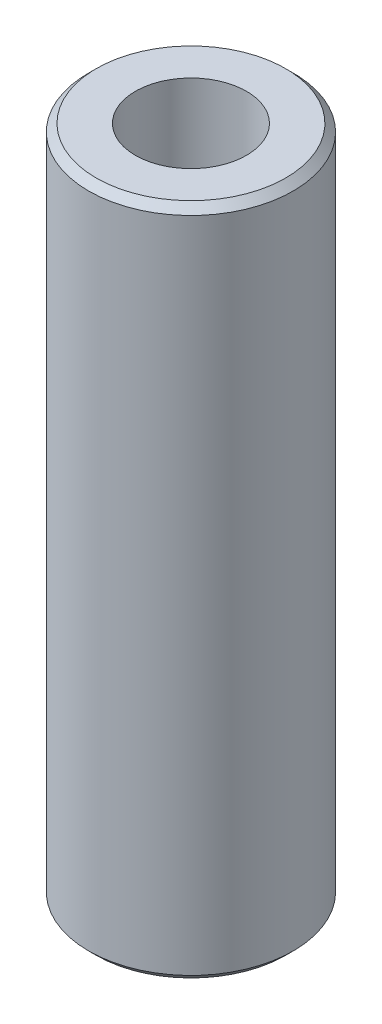
ISO-10303-21;
HEADER;
FILE_DESCRIPTION(('STEP AP214'),'2;1');
FILE_NAME('part.step','',(''),(''),'','','');
FILE_SCHEMA(('AUTOMOTIVE_DESIGN { 1 0 10303 214 1 1 1 1 }'));
ENDSEC;
DATA;
#1=APPLICATION_CONTEXT('core data for automotive mechanical design processes');
#2=APPLICATION_PROTOCOL_DEFINITION('international standard','automotive_design',2000,#1);
#3=PRODUCT_CONTEXT('',#1,'mechanical');
#4=PRODUCT('Part','Part','',(#3));
#5=PRODUCT_RELATED_PRODUCT_CATEGORY('part','',(#4));
#6=PRODUCT_DEFINITION_FORMATION('','',#4);
#7=PRODUCT_DEFINITION_CONTEXT('part definition',#1,'design');
#8=PRODUCT_DEFINITION('design','',#6,#7);
#9=PRODUCT_DEFINITION_SHAPE('','',#8);
#10=(LENGTH_UNIT() NAMED_UNIT(*) SI_UNIT(.MILLI.,.METRE.));
#11=(NAMED_UNIT(*) PLANE_ANGLE_UNIT() SI_UNIT($,.RADIAN.));
#12=(NAMED_UNIT(*) SI_UNIT($,.STERADIAN.) SOLID_ANGLE_UNIT());
#13=UNCERTAINTY_MEASURE_WITH_UNIT(LENGTH_MEASURE(1.E-05),#10,'distance_accuracy_value','');
#14=(GEOMETRIC_REPRESENTATION_CONTEXT(3) GLOBAL_UNCERTAINTY_ASSIGNED_CONTEXT((#13)) GLOBAL_UNIT_ASSIGNED_CONTEXT((#10,
#11,#12)) REPRESENTATION_CONTEXT('',''));
#15=CARTESIAN_POINT('',(0.,0.,0.));
#16=DIRECTION('',(0.,0.,1.));
#17=DIRECTION('',(1.,0.,0.));
#18=AXIS2_PLACEMENT_3D('',#15,#16,#17);
#19=CARTESIAN_POINT('',(0.,394.880098972398,0.));
#20=DIRECTION('',(0.,-1.,0.));
#21=DIRECTION('',(0.,0.,-1.));
#22=AXIS2_PLACEMENT_3D('',#19,#20,#21);
#23=CYLINDRICAL_SURFACE('',#22,60.);
#24=CARTESIAN_POINT('',(0.,390.468085987684,0.));
#25=DIRECTION('',(0.,1.,0.));
#26=DIRECTION('',(0.,0.,1.));
#27=AXIS2_PLACEMENT_3D('',#24,#25,#26);
#28=CIRCLE('',#27,60.);
#29=CARTESIAN_POINT('',(0.,390.468085987684,60.));
#30=VERTEX_POINT('',#29);
#31=EDGE_CURVE('E50',#30,#30,#28,.F.);
#32=ORIENTED_EDGE('',*,*,#31,.T.);
#33=EDGE_LOOP('',(#32));
#34=FACE_BOUND('',#33,.T.);
#35=CARTESIAN_POINT('',(0.,4.41201298471361,0.));
#36=DIRECTION('',(0.,1.,0.));
#37=DIRECTION('',(0.,0.,1.));
#38=AXIS2_PLACEMENT_3D('',#35,#36,#37);
#39=CIRCLE('',#38,60.);
#40=CARTESIAN_POINT('',(0.,4.41201298471361,60.));
#41=VERTEX_POINT('',#40);
#42=EDGE_CURVE('E51',#41,#41,#39,.T.);
#43=ORIENTED_EDGE('',*,*,#42,.T.);
#44=EDGE_LOOP('',(#43));
#45=FACE_BOUND('',#44,.T.);
#46=ADVANCED_FACE('F39',(#34,#45),#23,.T.);
#47=CARTESIAN_POINT('',(0.,394.880098972398,0.));
#48=DIRECTION('',(0.,1.,0.));
#49=DIRECTION('',(0.,0.,1.));
#50=AXIS2_PLACEMENT_3D('',#47,#48,#49);
#51=PLANE('',#50);
#52=CARTESIAN_POINT('',(0.,394.880098972398,0.));
#53=DIRECTION('',(0.,1.,0.));
#54=DIRECTION('',(0.,0.,1.));
#55=AXIS2_PLACEMENT_3D('',#52,#53,#54);
#56=CIRCLE('',#55,55.5879870152864);
#57=CARTESIAN_POINT('',(0.,394.880098972398,55.5879870152864));
#58=VERTEX_POINT('',#57);
#59=EDGE_CURVE('E54',#58,#58,#56,.T.);
#60=ORIENTED_EDGE('',*,*,#59,.T.);
#61=EDGE_LOOP('',(#60));
#62=FACE_BOUND('',#61,.T.);
#63=CARTESIAN_POINT('',(0.,394.880098972398,0.));
#64=DIRECTION('',(0.,1.,0.));
#65=DIRECTION('',(0.,0.,1.));
#66=AXIS2_PLACEMENT_3D('',#63,#64,#65);
#67=CIRCLE('',#66,32.58080413881);
#68=CARTESIAN_POINT('',(0.,394.880098972398,32.58080413881));
#69=VERTEX_POINT('',#68);
#70=EDGE_CURVE('E58',#69,#69,#67,.T.);
#71=ORIENTED_EDGE('',*,*,#70,.F.);
#72=EDGE_LOOP('',(#71));
#73=FACE_BOUND('',#72,.T.);
#74=ADVANCED_FACE('F69',(#62,#73),#51,.T.);
#75=CARTESIAN_POINT('',(0.,0.,0.));
#76=DIRECTION('',(0.,1.,0.));
#77=DIRECTION('',(0.,0.,1.));
#78=AXIS2_PLACEMENT_3D('',#75,#76,#77);
#79=PLANE('',#78);
#80=CARTESIAN_POINT('',(0.,0.,0.));
#81=DIRECTION('',(0.,1.,0.));
#82=DIRECTION('',(0.,0.,1.));
#83=AXIS2_PLACEMENT_3D('',#80,#81,#82);
#84=CIRCLE('',#83,55.5879870152864);
#85=CARTESIAN_POINT('',(0.,0.,55.5879870152864));
#86=VERTEX_POINT('',#85);
#87=EDGE_CURVE('E10',#86,#86,#84,.F.);
#88=ORIENTED_EDGE('',*,*,#87,.T.);
#89=EDGE_LOOP('',(#88));
#90=FACE_BOUND('',#89,.T.);
#91=CARTESIAN_POINT('',(0.,0.,0.));
#92=DIRECTION('',(0.,1.,0.));
#93=DIRECTION('',(0.,0.,1.));
#94=AXIS2_PLACEMENT_3D('',#91,#92,#93);
#95=CIRCLE('',#94,32.58080413881);
#96=CARTESIAN_POINT('',(0.,0.,32.58080413881));
#97=VERTEX_POINT('',#96);
#98=EDGE_CURVE('E63',#97,#97,#95,.T.);
#99=ORIENTED_EDGE('',*,*,#98,.T.);
#100=EDGE_LOOP('',(#99));
#101=FACE_BOUND('',#100,.T.);
#102=ADVANCED_FACE('F75',(#90,#101),#79,.F.);
#103=CARTESIAN_POINT('',(0.,394.880098972398,0.));
#104=DIRECTION('',(0.,-1.,0.));
#105=DIRECTION('',(0.,0.,-1.));
#106=AXIS2_PLACEMENT_3D('',#103,#104,#105);
#107=CYLINDRICAL_SURFACE('',#106,32.58080413881);
#108=ORIENTED_EDGE('',*,*,#70,.T.);
#109=EDGE_LOOP('',(#108));
#110=FACE_BOUND('',#109,.T.);
#111=ORIENTED_EDGE('',*,*,#98,.F.);
#112=EDGE_LOOP('',(#111));
#113=FACE_BOUND('',#112,.T.);
#114=ADVANCED_FACE('F70',(#110,#113),#107,.F.);
#115=CARTESIAN_POINT('',(0.,394.880098972398,0.));
#116=DIRECTION('',(0.,-1.,0.));
#117=DIRECTION('',(0.,0.,-1.));
#118=AXIS2_PLACEMENT_3D('',#115,#116,#117);
#119=CONICAL_SURFACE('',#118,55.5879870152864,0.785398163397442);
#120=ORIENTED_EDGE('',*,*,#31,.F.);
#121=EDGE_LOOP('',(#120));
#122=FACE_BOUND('',#121,.T.);
#123=ORIENTED_EDGE('',*,*,#59,.F.);
#124=EDGE_LOOP('',(#123));
#125=FACE_BOUND('',#124,.T.);
#126=ADVANCED_FACE('F81',(#122,#125),#119,.T.);
#127=CARTESIAN_POINT('',(0.,4.41201298471361,0.));
#128=DIRECTION('',(0.,1.,0.));
#129=DIRECTION('',(0.,0.,1.));
#130=AXIS2_PLACEMENT_3D('',#127,#128,#129);
#131=CONICAL_SURFACE('',#130,60.,0.785398163397451);
#132=ORIENTED_EDGE('',*,*,#87,.F.);
#133=EDGE_LOOP('',(#132));
#134=FACE_BOUND('',#133,.T.);
#135=ORIENTED_EDGE('',*,*,#42,.F.);
#136=EDGE_LOOP('',(#135));
#137=FACE_BOUND('',#136,.T.);
#138=ADVANCED_FACE('F45',(#134,#137),#131,.T.);
#139=CLOSED_SHELL('',(#46,#74,#102,#114,#126,#138));
#140=MANIFOLD_SOLID_BREP('B2',#139);
#141=ADVANCED_BREP_SHAPE_REPRESENTATION('',(#18,#140),#14);
#142=SHAPE_DEFINITION_REPRESENTATION(#9,#141);
ENDSEC;
END-ISO-10303-21;
